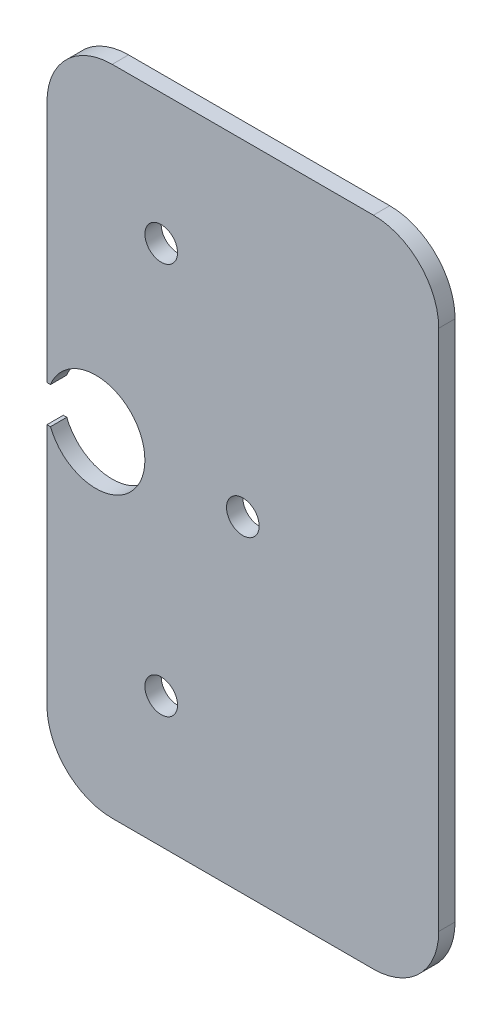
ISO-10303-21;
HEADER;
FILE_DESCRIPTION(('STEP AP214'),'2;1');
FILE_NAME('part.step','',(''),(''),'','','');
FILE_SCHEMA(('AUTOMOTIVE_DESIGN { 1 0 10303 214 1 1 1 1 }'));
ENDSEC;
DATA;
#1=APPLICATION_CONTEXT('core data for automotive mechanical design processes');
#2=APPLICATION_PROTOCOL_DEFINITION('international standard','automotive_design',2000,#1);
#3=PRODUCT_CONTEXT('',#1,'mechanical');
#4=PRODUCT('Part','Part','',(#3));
#5=PRODUCT_RELATED_PRODUCT_CATEGORY('part','',(#4));
#6=PRODUCT_DEFINITION_FORMATION('','',#4);
#7=PRODUCT_DEFINITION_CONTEXT('part definition',#1,'design');
#8=PRODUCT_DEFINITION('design','',#6,#7);
#9=PRODUCT_DEFINITION_SHAPE('','',#8);
#10=(LENGTH_UNIT() NAMED_UNIT(*) SI_UNIT(.MILLI.,.METRE.));
#11=(NAMED_UNIT(*) PLANE_ANGLE_UNIT() SI_UNIT($,.RADIAN.));
#12=(NAMED_UNIT(*) SI_UNIT($,.STERADIAN.) SOLID_ANGLE_UNIT());
#13=UNCERTAINTY_MEASURE_WITH_UNIT(LENGTH_MEASURE(1.E-05),#10,'distance_accuracy_value','');
#14=(GEOMETRIC_REPRESENTATION_CONTEXT(3) GLOBAL_UNCERTAINTY_ASSIGNED_CONTEXT((#13)) GLOBAL_UNIT_ASSIGNED_CONTEXT((#10,
#11,#12)) REPRESENTATION_CONTEXT('',''));
#15=CARTESIAN_POINT('',(0.,0.,0.));
#16=DIRECTION('',(0.,0.,1.));
#17=DIRECTION('',(1.,0.,0.));
#18=AXIS2_PLACEMENT_3D('',#15,#16,#17);
#19=CARTESIAN_POINT('',(-450.215,1024.45552803745,3.175));
#20=DIRECTION('',(0.,0.,1.));
#21=DIRECTION('',(0.,1.,0.));
#22=AXIS2_PLACEMENT_3D('',#19,#20,#21);
#23=ELLIPSE('',#22,9.54794789392333,9.52500000000006);
#24=DIRECTION('',(0.,0.,-1.));
#25=VECTOR('',#24,1.);
#26=SURFACE_OF_LINEAR_EXTRUSION('',#23,#25);
#27=CARTESIAN_POINT('',(-450.215,1024.45552803745,0.));
#28=DIRECTION('',(0.,0.,1.));
#29=DIRECTION('',(0.,1.,0.));
#30=AXIS2_PLACEMENT_3D('',#27,#28,#29);
#31=ELLIPSE('',#30,9.54794789392333,9.52500000000006);
#32=CARTESIAN_POINT('',(-459.058883104327,1020.90986665038,0.));
#33=VERTEX_POINT('',#32);
#34=CARTESIAN_POINT('',(-459.058883104327,1028.00118942453,0.));
#35=VERTEX_POINT('',#34);
#36=EDGE_CURVE('E163',#33,#35,#31,.T.);
#37=ORIENTED_EDGE('',*,*,#36,.F.);
#38=DIRECTION('',(0.,0.,-1.));
#39=VECTOR('',#38,1.);
#40=CARTESIAN_POINT('',(-459.058883104327,1020.90986665038,3.175));
#41=LINE('',#40,#39);
#42=CARTESIAN_POINT('',(-459.058883104327,1020.90986665038,3.175));
#43=VERTEX_POINT('',#42);
#44=EDGE_CURVE('E11',#43,#33,#41,.T.);
#45=ORIENTED_EDGE('',*,*,#44,.F.);
#46=CARTESIAN_POINT('',(-459.058883104327,1028.00118942453,3.175));
#47=VERTEX_POINT('',#46);
#48=EDGE_CURVE('E202',#43,#47,#23,.T.);
#49=ORIENTED_EDGE('',*,*,#48,.T.);
#50=DIRECTION('',(0.,0.,-1.));
#51=VECTOR('',#50,1.);
#52=CARTESIAN_POINT('',(-459.058883104327,1028.00118942453,3.175));
#53=LINE('',#52,#51);
#54=EDGE_CURVE('E98',#47,#35,#53,.T.);
#55=ORIENTED_EDGE('',*,*,#54,.T.);
#56=EDGE_LOOP('',(#37,#45,#49,#55));
#57=FACE_BOUND('',#56,.T.);
#58=ADVANCED_FACE('F35',(#57),#26,.T.);
#59=CARTESIAN_POINT('',(0.,1020.90986665038,3.175));
#60=DIRECTION('',(0.,1.,0.));
#61=DIRECTION('',(0.,0.,1.));
#62=AXIS2_PLACEMENT_3D('',#59,#60,#61);
#63=PLANE('',#62);
#64=DIRECTION('',(1.,0.,0.));
#65=VECTOR('',#64,1.);
#66=CARTESIAN_POINT('',(0.,1020.90986665038,0.));
#67=LINE('',#66,#65);
#68=CARTESIAN_POINT('',(-459.74,1020.90986665038,0.));
#69=VERTEX_POINT('',#68);
#70=EDGE_CURVE('E166',#69,#33,#67,.T.);
#71=ORIENTED_EDGE('',*,*,#70,.F.);
#72=DIRECTION('',(0.,0.,-1.));
#73=VECTOR('',#72,1.);
#74=CARTESIAN_POINT('',(-459.74,1020.90986665038,3.175));
#75=LINE('',#74,#73);
#76=CARTESIAN_POINT('',(-459.74,1020.90986665038,3.175));
#77=VERTEX_POINT('',#76);
#78=EDGE_CURVE('E44',#77,#69,#75,.T.);
#79=ORIENTED_EDGE('',*,*,#78,.F.);
#80=DIRECTION('',(1.,0.,0.));
#81=VECTOR('',#80,1.);
#82=CARTESIAN_POINT('',(0.,1020.90986665038,3.175));
#83=LINE('',#82,#81);
#84=EDGE_CURVE('E242',#77,#43,#83,.T.);
#85=ORIENTED_EDGE('',*,*,#84,.T.);
#86=ORIENTED_EDGE('',*,*,#44,.T.);
#87=EDGE_LOOP('',(#71,#79,#85,#86));
#88=FACE_BOUND('',#87,.T.);
#89=ADVANCED_FACE('F229',(#88),#63,.T.);
#90=CARTESIAN_POINT('',(-459.74,0.,3.175));
#91=DIRECTION('',(-1.,0.,0.));
#92=DIRECTION('',(0.,0.,1.));
#93=AXIS2_PLACEMENT_3D('',#90,#91,#92);
#94=PLANE('',#93);
#95=DIRECTION('',(0.,1.,0.));
#96=VECTOR('',#95,1.);
#97=CARTESIAN_POINT('',(-459.74,0.,0.));
#98=LINE('',#97,#96);
#99=CARTESIAN_POINT('',(-459.74,973.655528037452,0.));
#100=VERTEX_POINT('',#99);
#101=EDGE_CURVE('E169',#100,#69,#98,.T.);
#102=ORIENTED_EDGE('',*,*,#101,.F.);
#103=DIRECTION('',(0.,0.,-1.));
#104=VECTOR('',#103,1.);
#105=CARTESIAN_POINT('',(-459.74,973.655528037452,3.175));
#106=LINE('',#105,#104);
#107=CARTESIAN_POINT('',(-459.74,973.655528037452,3.175));
#108=VERTEX_POINT('',#107);
#109=EDGE_CURVE('E218',#108,#100,#106,.T.);
#110=ORIENTED_EDGE('',*,*,#109,.F.);
#111=DIRECTION('',(0.,1.,0.));
#112=VECTOR('',#111,1.);
#113=CARTESIAN_POINT('',(-459.74,0.,3.175));
#114=LINE('',#113,#112);
#115=EDGE_CURVE('E225',#108,#77,#114,.T.);
#116=ORIENTED_EDGE('',*,*,#115,.T.);
#117=ORIENTED_EDGE('',*,*,#78,.T.);
#118=EDGE_LOOP('',(#102,#110,#116,#117));
#119=FACE_BOUND('',#118,.T.);
#120=ADVANCED_FACE('F223',(#119),#94,.T.);
#121=CARTESIAN_POINT('',(-447.04,973.655528037452,3.175));
#122=DIRECTION('',(0.,0.,-1.));
#123=DIRECTION('',(-1.,0.,0.));
#124=AXIS2_PLACEMENT_3D('',#121,#122,#123);
#125=CYLINDRICAL_SURFACE('',#124,12.7);
#126=CARTESIAN_POINT('',(-447.04,973.655528037452,0.));
#127=DIRECTION('',(0.,0.,1.));
#128=DIRECTION('',(1.,0.,0.));
#129=AXIS2_PLACEMENT_3D('',#126,#127,#128);
#130=CIRCLE('',#129,12.7);
#131=CARTESIAN_POINT('',(-447.04,960.955528037452,0.));
#132=VERTEX_POINT('',#131);
#133=EDGE_CURVE('E172',#132,#100,#130,.F.);
#134=ORIENTED_EDGE('',*,*,#133,.F.);
#135=DIRECTION('',(0.,0.,-1.));
#136=VECTOR('',#135,1.);
#137=CARTESIAN_POINT('',(-447.04,960.955528037452,3.175));
#138=LINE('',#137,#136);
#139=CARTESIAN_POINT('',(-447.04,960.955528037452,3.175));
#140=VERTEX_POINT('',#139);
#141=EDGE_CURVE('E216',#140,#132,#138,.T.);
#142=ORIENTED_EDGE('',*,*,#141,.F.);
#143=CARTESIAN_POINT('',(-447.04,973.655528037452,3.175));
#144=DIRECTION('',(0.,0.,1.));
#145=DIRECTION('',(1.,0.,0.));
#146=AXIS2_PLACEMENT_3D('',#143,#144,#145);
#147=CIRCLE('',#146,12.7);
#148=EDGE_CURVE('E241',#140,#108,#147,.F.);
#149=ORIENTED_EDGE('',*,*,#148,.T.);
#150=ORIENTED_EDGE('',*,*,#109,.T.);
#151=EDGE_LOOP('',(#134,#142,#149,#150));
#152=FACE_BOUND('',#151,.T.);
#153=ADVANCED_FACE('F237',(#152),#125,.T.);
#154=CARTESIAN_POINT('',(2.10014754501576E-12,960.955528037451,3.175));
#155=DIRECTION('',(0.,1.,0.));
#156=DIRECTION('',(-1.,0.,0.));
#157=AXIS2_PLACEMENT_3D('',#154,#155,#156);
#158=PLANE('',#157);
#159=DIRECTION('',(1.,0.,0.));
#160=VECTOR('',#159,1.);
#161=CARTESIAN_POINT('',(2.10014754501576E-12,960.955528037451,0.));
#162=LINE('',#161,#160);
#163=CARTESIAN_POINT('',(-396.24,960.955528037452,0.));
#164=VERTEX_POINT('',#163);
#165=EDGE_CURVE('E175',#132,#164,#162,.T.);
#166=ORIENTED_EDGE('',*,*,#165,.T.);
#167=DIRECTION('',(0.,0.,-1.));
#168=VECTOR('',#167,1.);
#169=CARTESIAN_POINT('',(-396.24,960.955528037452,3.175));
#170=LINE('',#169,#168);
#171=CARTESIAN_POINT('',(-396.24,960.955528037452,3.175));
#172=VERTEX_POINT('',#171);
#173=EDGE_CURVE('E213',#172,#164,#170,.T.);
#174=ORIENTED_EDGE('',*,*,#173,.F.);
#175=DIRECTION('',(1.,0.,0.));
#176=VECTOR('',#175,1.);
#177=CARTESIAN_POINT('',(2.10014754501576E-12,960.955528037451,3.175));
#178=LINE('',#177,#176);
#179=EDGE_CURVE('E244',#140,#172,#178,.T.);
#180=ORIENTED_EDGE('',*,*,#179,.F.);
#181=ORIENTED_EDGE('',*,*,#141,.T.);
#182=EDGE_LOOP('',(#166,#174,#180,#181));
#183=FACE_BOUND('',#182,.T.);
#184=ADVANCED_FACE('F272',(#183),#158,.F.);
#185=CARTESIAN_POINT('',(-396.24,973.655528037452,3.175));
#186=DIRECTION('',(0.,0.,-1.));
#187=DIRECTION('',(-1.,0.,0.));
#188=AXIS2_PLACEMENT_3D('',#185,#186,#187);
#189=CYLINDRICAL_SURFACE('',#188,12.7);
#190=CARTESIAN_POINT('',(-396.24,973.655528037452,0.));
#191=DIRECTION('',(0.,0.,1.));
#192=DIRECTION('',(1.,0.,0.));
#193=AXIS2_PLACEMENT_3D('',#190,#191,#192);
#194=CIRCLE('',#193,12.7);
#195=CARTESIAN_POINT('',(-383.54,973.655528037452,0.));
#196=VERTEX_POINT('',#195);
#197=EDGE_CURVE('E177',#164,#196,#194,.T.);
#198=ORIENTED_EDGE('',*,*,#197,.T.);
#199=DIRECTION('',(0.,0.,-1.));
#200=VECTOR('',#199,1.);
#201=CARTESIAN_POINT('',(-383.54,973.655528037452,3.175));
#202=LINE('',#201,#200);
#203=CARTESIAN_POINT('',(-383.54,973.655528037452,3.175));
#204=VERTEX_POINT('',#203);
#205=EDGE_CURVE('E210',#204,#196,#202,.T.);
#206=ORIENTED_EDGE('',*,*,#205,.F.);
#207=CARTESIAN_POINT('',(-396.24,973.655528037452,3.175));
#208=DIRECTION('',(0.,0.,1.));
#209=DIRECTION('',(1.,0.,0.));
#210=AXIS2_PLACEMENT_3D('',#207,#208,#209);
#211=CIRCLE('',#210,12.7);
#212=EDGE_CURVE('E249',#172,#204,#211,.T.);
#213=ORIENTED_EDGE('',*,*,#212,.F.);
#214=ORIENTED_EDGE('',*,*,#173,.T.);
#215=EDGE_LOOP('',(#198,#206,#213,#214));
#216=FACE_BOUND('',#215,.T.);
#217=ADVANCED_FACE('F275',(#216),#189,.T.);
#218=CARTESIAN_POINT('',(-383.54,0.,3.175));
#219=DIRECTION('',(-1.,0.,0.));
#220=DIRECTION('',(0.,0.,1.));
#221=AXIS2_PLACEMENT_3D('',#218,#219,#220);
#222=PLANE('',#221);
#223=DIRECTION('',(0.,1.,0.));
#224=VECTOR('',#223,1.);
#225=CARTESIAN_POINT('',(-383.54,0.,0.));
#226=LINE('',#225,#224);
#227=CARTESIAN_POINT('',(-383.54,1075.25552803745,0.));
#228=VERTEX_POINT('',#227);
#229=EDGE_CURVE('E179',#196,#228,#226,.T.);
#230=ORIENTED_EDGE('',*,*,#229,.T.);
#231=DIRECTION('',(0.,0.,-1.));
#232=VECTOR('',#231,1.);
#233=CARTESIAN_POINT('',(-383.54,1075.25552803745,3.175));
#234=LINE('',#233,#232);
#235=CARTESIAN_POINT('',(-383.54,1075.25552803745,3.175));
#236=VERTEX_POINT('',#235);
#237=EDGE_CURVE('E208',#236,#228,#234,.T.);
#238=ORIENTED_EDGE('',*,*,#237,.F.);
#239=DIRECTION('',(0.,1.,0.));
#240=VECTOR('',#239,1.);
#241=CARTESIAN_POINT('',(-383.54,0.,3.175));
#242=LINE('',#241,#240);
#243=EDGE_CURVE('E251',#204,#236,#242,.T.);
#244=ORIENTED_EDGE('',*,*,#243,.F.);
#245=ORIENTED_EDGE('',*,*,#205,.T.);
#246=EDGE_LOOP('',(#230,#238,#244,#245));
#247=FACE_BOUND('',#246,.T.);
#248=ADVANCED_FACE('F279',(#247),#222,.F.);
#249=CARTESIAN_POINT('',(-396.24,1075.25552803745,3.175));
#250=DIRECTION('',(0.,0.,-1.));
#251=DIRECTION('',(-1.,0.,0.));
#252=AXIS2_PLACEMENT_3D('',#249,#250,#251);
#253=CYLINDRICAL_SURFACE('',#252,12.7);
#254=CARTESIAN_POINT('',(-396.24,1075.25552803745,0.));
#255=DIRECTION('',(0.,0.,1.));
#256=DIRECTION('',(1.,0.,0.));
#257=AXIS2_PLACEMENT_3D('',#254,#255,#256);
#258=CIRCLE('',#257,12.7);
#259=CARTESIAN_POINT('',(-396.24,1087.95552803745,0.));
#260=VERTEX_POINT('',#259);
#261=EDGE_CURVE('E182',#260,#228,#258,.F.);
#262=ORIENTED_EDGE('',*,*,#261,.F.);
#263=DIRECTION('',(0.,0.,-1.));
#264=VECTOR('',#263,1.);
#265=CARTESIAN_POINT('',(-396.24,1087.95552803745,3.175));
#266=LINE('',#265,#264);
#267=CARTESIAN_POINT('',(-396.24,1087.95552803745,3.175));
#268=VERTEX_POINT('',#267);
#269=EDGE_CURVE('E206',#268,#260,#266,.T.);
#270=ORIENTED_EDGE('',*,*,#269,.F.);
#271=CARTESIAN_POINT('',(-396.24,1075.25552803745,3.175));
#272=DIRECTION('',(0.,0.,1.));
#273=DIRECTION('',(1.,0.,0.));
#274=AXIS2_PLACEMENT_3D('',#271,#272,#273);
#275=CIRCLE('',#274,12.7);
#276=EDGE_CURVE('E253',#268,#236,#275,.F.);
#277=ORIENTED_EDGE('',*,*,#276,.T.);
#278=ORIENTED_EDGE('',*,*,#237,.T.);
#279=EDGE_LOOP('',(#262,#270,#277,#278));
#280=FACE_BOUND('',#279,.T.);
#281=ADVANCED_FACE('F283',(#280),#253,.T.);
#282=CARTESIAN_POINT('',(0.,1087.95552803745,3.175));
#283=DIRECTION('',(0.,1.,0.));
#284=DIRECTION('',(0.,0.,1.));
#285=AXIS2_PLACEMENT_3D('',#282,#283,#284);
#286=PLANE('',#285);
#287=DIRECTION('',(1.,0.,0.));
#288=VECTOR('',#287,1.);
#289=CARTESIAN_POINT('',(0.,1087.95552803745,0.));
#290=LINE('',#289,#288);
#291=CARTESIAN_POINT('',(-447.04,1087.95552803745,0.));
#292=VERTEX_POINT('',#291);
#293=EDGE_CURVE('E185',#292,#260,#290,.T.);
#294=ORIENTED_EDGE('',*,*,#293,.F.);
#295=DIRECTION('',(0.,0.,-1.));
#296=VECTOR('',#295,1.);
#297=CARTESIAN_POINT('',(-447.04,1087.95552803745,3.175));
#298=LINE('',#297,#296);
#299=CARTESIAN_POINT('',(-447.04,1087.95552803745,3.175));
#300=VERTEX_POINT('',#299);
#301=EDGE_CURVE('E139',#300,#292,#298,.T.);
#302=ORIENTED_EDGE('',*,*,#301,.F.);
#303=DIRECTION('',(1.,0.,0.));
#304=VECTOR('',#303,1.);
#305=CARTESIAN_POINT('',(0.,1087.95552803745,3.175));
#306=LINE('',#305,#304);
#307=EDGE_CURVE('E147',#300,#268,#306,.T.);
#308=ORIENTED_EDGE('',*,*,#307,.T.);
#309=ORIENTED_EDGE('',*,*,#269,.T.);
#310=EDGE_LOOP('',(#294,#302,#308,#309));
#311=FACE_BOUND('',#310,.T.);
#312=ADVANCED_FACE('F257',(#311),#286,.T.);
#313=CARTESIAN_POINT('',(-447.04,1075.25552803745,3.175));
#314=DIRECTION('',(0.,0.,-1.));
#315=DIRECTION('',(-1.,0.,0.));
#316=AXIS2_PLACEMENT_3D('',#313,#314,#315);
#317=CYLINDRICAL_SURFACE('',#316,12.7);
#318=CARTESIAN_POINT('',(-447.04,1075.25552803745,0.));
#319=DIRECTION('',(0.,0.,1.));
#320=DIRECTION('',(1.,0.,0.));
#321=AXIS2_PLACEMENT_3D('',#318,#319,#320);
#322=CIRCLE('',#321,12.7);
#323=CARTESIAN_POINT('',(-459.74,1075.25552803745,0.));
#324=VERTEX_POINT('',#323);
#325=EDGE_CURVE('E134',#324,#292,#322,.F.);
#326=ORIENTED_EDGE('',*,*,#325,.F.);
#327=DIRECTION('',(0.,0.,-1.));
#328=VECTOR('',#327,1.);
#329=CARTESIAN_POINT('',(-459.74,1075.25552803745,3.175));
#330=LINE('',#329,#328);
#331=CARTESIAN_POINT('',(-459.74,1075.25552803745,3.175));
#332=VERTEX_POINT('',#331);
#333=EDGE_CURVE('E129',#332,#324,#330,.T.);
#334=ORIENTED_EDGE('',*,*,#333,.F.);
#335=CARTESIAN_POINT('',(-447.04,1075.25552803745,3.175));
#336=DIRECTION('',(0.,0.,1.));
#337=DIRECTION('',(1.,0.,0.));
#338=AXIS2_PLACEMENT_3D('',#335,#336,#337);
#339=CIRCLE('',#338,12.7);
#340=EDGE_CURVE('E132',#332,#300,#339,.F.);
#341=ORIENTED_EDGE('',*,*,#340,.T.);
#342=ORIENTED_EDGE('',*,*,#301,.T.);
#343=EDGE_LOOP('',(#326,#334,#341,#342));
#344=FACE_BOUND('',#343,.T.);
#345=ADVANCED_FACE('F131',(#344),#317,.T.);
#346=CARTESIAN_POINT('',(-459.74,0.,3.175));
#347=DIRECTION('',(-1.,0.,0.));
#348=DIRECTION('',(0.,0.,1.));
#349=AXIS2_PLACEMENT_3D('',#346,#347,#348);
#350=PLANE('',#349);
#351=DIRECTION('',(0.,1.,0.));
#352=VECTOR('',#351,1.);
#353=CARTESIAN_POINT('',(-459.74,0.,0.));
#354=LINE('',#353,#352);
#355=CARTESIAN_POINT('',(-459.74,1028.00118942453,0.));
#356=VERTEX_POINT('',#355);
#357=EDGE_CURVE('E189',#356,#324,#354,.T.);
#358=ORIENTED_EDGE('',*,*,#357,.F.);
#359=DIRECTION('',(0.,0.,-1.));
#360=VECTOR('',#359,1.);
#361=CARTESIAN_POINT('',(-459.74,1028.00118942453,3.175));
#362=LINE('',#361,#360);
#363=CARTESIAN_POINT('',(-459.74,1028.00118942453,3.175));
#364=VERTEX_POINT('',#363);
#365=EDGE_CURVE('E91',#364,#356,#362,.T.);
#366=ORIENTED_EDGE('',*,*,#365,.F.);
#367=DIRECTION('',(0.,1.,0.));
#368=VECTOR('',#367,1.);
#369=CARTESIAN_POINT('',(-459.74,0.,3.175));
#370=LINE('',#369,#368);
#371=EDGE_CURVE('E144',#364,#332,#370,.T.);
#372=ORIENTED_EDGE('',*,*,#371,.T.);
#373=ORIENTED_EDGE('',*,*,#333,.T.);
#374=EDGE_LOOP('',(#358,#366,#372,#373));
#375=FACE_BOUND('',#374,.T.);
#376=ADVANCED_FACE('F149',(#375),#350,.T.);
#377=CARTESIAN_POINT('',(-437.515,986.355528037452,3.175));
#378=DIRECTION('',(0.,0.,-1.));
#379=DIRECTION('',(-1.,0.,0.));
#380=AXIS2_PLACEMENT_3D('',#377,#378,#379);
#381=CYLINDRICAL_SURFACE('',#380,3.17499999999981);
#382=CARTESIAN_POINT('',(-437.515,986.355528037452,3.175));
#383=DIRECTION('',(0.,0.,1.));
#384=DIRECTION('',(1.,0.,0.));
#385=AXIS2_PLACEMENT_3D('',#382,#383,#384);
#386=CIRCLE('',#385,3.17499999999981);
#387=CARTESIAN_POINT('',(-434.34,986.355528037452,3.175));
#388=VERTEX_POINT('',#387);
#389=EDGE_CURVE('E157',#388,#388,#386,.T.);
#390=ORIENTED_EDGE('',*,*,#389,.T.);
#391=EDGE_LOOP('',(#390));
#392=FACE_BOUND('',#391,.T.);
#393=CARTESIAN_POINT('',(-437.515,986.355528037452,0.));
#394=DIRECTION('',(0.,0.,1.));
#395=DIRECTION('',(1.,0.,0.));
#396=AXIS2_PLACEMENT_3D('',#393,#394,#395);
#397=CIRCLE('',#396,3.17499999999981);
#398=CARTESIAN_POINT('',(-434.34,986.355528037452,0.));
#399=VERTEX_POINT('',#398);
#400=EDGE_CURVE('E196',#399,#399,#397,.T.);
#401=ORIENTED_EDGE('',*,*,#400,.F.);
#402=EDGE_LOOP('',(#401));
#403=FACE_BOUND('',#402,.T.);
#404=ADVANCED_FACE('F294',(#392,#403),#381,.F.);
#405=CARTESIAN_POINT('',(-421.64,1024.45552803745,3.175));
#406=DIRECTION('',(0.,0.,-1.));
#407=DIRECTION('',(-1.,0.,0.));
#408=AXIS2_PLACEMENT_3D('',#405,#406,#407);
#409=CYLINDRICAL_SURFACE('',#408,3.17499999999967);
#410=CARTESIAN_POINT('',(-421.64,1024.45552803745,3.175));
#411=DIRECTION('',(0.,0.,1.));
#412=DIRECTION('',(1.,0.,0.));
#413=AXIS2_PLACEMENT_3D('',#410,#411,#412);
#414=CIRCLE('',#413,3.17499999999967);
#415=CARTESIAN_POINT('',(-418.465,1024.45552803745,3.175));
#416=VERTEX_POINT('',#415);
#417=EDGE_CURVE('E151',#416,#416,#414,.T.);
#418=ORIENTED_EDGE('',*,*,#417,.T.);
#419=EDGE_LOOP('',(#418));
#420=FACE_BOUND('',#419,.T.);
#421=CARTESIAN_POINT('',(-421.64,1024.45552803745,0.));
#422=DIRECTION('',(0.,0.,1.));
#423=DIRECTION('',(1.,0.,0.));
#424=AXIS2_PLACEMENT_3D('',#421,#422,#423);
#425=CIRCLE('',#424,3.17499999999967);
#426=CARTESIAN_POINT('',(-418.465,1024.45552803745,0.));
#427=VERTEX_POINT('',#426);
#428=EDGE_CURVE('E193',#427,#427,#425,.T.);
#429=ORIENTED_EDGE('',*,*,#428,.F.);
#430=EDGE_LOOP('',(#429));
#431=FACE_BOUND('',#430,.T.);
#432=ADVANCED_FACE('F298',(#420,#431),#409,.F.);
#433=CARTESIAN_POINT('',(0.,1028.00118942453,3.175));
#434=DIRECTION('',(0.,1.,0.));
#435=DIRECTION('',(0.,0.,1.));
#436=AXIS2_PLACEMENT_3D('',#433,#434,#435);
#437=PLANE('',#436);
#438=DIRECTION('',(1.,0.,0.));
#439=VECTOR('',#438,1.);
#440=CARTESIAN_POINT('',(0.,1028.00118942453,0.));
#441=LINE('',#440,#439);
#442=EDGE_CURVE('E191',#356,#35,#441,.T.);
#443=ORIENTED_EDGE('',*,*,#442,.T.);
#444=ORIENTED_EDGE('',*,*,#54,.F.);
#445=DIRECTION('',(1.,0.,0.));
#446=VECTOR('',#445,1.);
#447=CARTESIAN_POINT('',(0.,1028.00118942453,3.175));
#448=LINE('',#447,#446);
#449=EDGE_CURVE('E52',#364,#47,#448,.T.);
#450=ORIENTED_EDGE('',*,*,#449,.F.);
#451=ORIENTED_EDGE('',*,*,#365,.T.);
#452=EDGE_LOOP('',(#443,#444,#450,#451));
#453=FACE_BOUND('',#452,.T.);
#454=ADVANCED_FACE('F259',(#453),#437,.F.);
#455=CARTESIAN_POINT('',(-437.515,1062.55552803745,3.175));
#456=DIRECTION('',(0.,0.,-1.));
#457=DIRECTION('',(-1.,0.,0.));
#458=AXIS2_PLACEMENT_3D('',#455,#456,#457);
#459=CYLINDRICAL_SURFACE('',#458,3.17499999999967);
#460=CARTESIAN_POINT('',(-437.515,1062.55552803745,3.175));
#461=DIRECTION('',(0.,0.,1.));
#462=DIRECTION('',(1.,0.,0.));
#463=AXIS2_PLACEMENT_3D('',#460,#461,#462);
#464=CIRCLE('',#463,3.17499999999967);
#465=CARTESIAN_POINT('',(-434.34,1062.55552803745,3.175));
#466=VERTEX_POINT('',#465);
#467=EDGE_CURVE('E160',#466,#466,#464,.T.);
#468=ORIENTED_EDGE('',*,*,#467,.T.);
#469=EDGE_LOOP('',(#468));
#470=FACE_BOUND('',#469,.T.);
#471=CARTESIAN_POINT('',(-437.515,1062.55552803745,0.));
#472=DIRECTION('',(0.,0.,1.));
#473=DIRECTION('',(1.,0.,0.));
#474=AXIS2_PLACEMENT_3D('',#471,#472,#473);
#475=CIRCLE('',#474,3.17499999999967);
#476=CARTESIAN_POINT('',(-434.34,1062.55552803745,0.));
#477=VERTEX_POINT('',#476);
#478=EDGE_CURVE('E199',#477,#477,#475,.T.);
#479=ORIENTED_EDGE('',*,*,#478,.F.);
#480=EDGE_LOOP('',(#479));
#481=FACE_BOUND('',#480,.T.);
#482=ADVANCED_FACE('F297',(#470,#481),#459,.F.);
#483=CARTESIAN_POINT('',(0.,0.,3.175));
#484=DIRECTION('',(0.,0.,1.));
#485=DIRECTION('',(1.,0.,0.));
#486=AXIS2_PLACEMENT_3D('',#483,#484,#485);
#487=PLANE('',#486);
#488=ORIENTED_EDGE('',*,*,#48,.F.);
#489=ORIENTED_EDGE('',*,*,#84,.F.);
#490=ORIENTED_EDGE('',*,*,#115,.F.);
#491=ORIENTED_EDGE('',*,*,#148,.F.);
#492=ORIENTED_EDGE('',*,*,#179,.T.);
#493=ORIENTED_EDGE('',*,*,#212,.T.);
#494=ORIENTED_EDGE('',*,*,#243,.T.);
#495=ORIENTED_EDGE('',*,*,#276,.F.);
#496=ORIENTED_EDGE('',*,*,#307,.F.);
#497=ORIENTED_EDGE('',*,*,#340,.F.);
#498=ORIENTED_EDGE('',*,*,#371,.F.);
#499=ORIENTED_EDGE('',*,*,#449,.T.);
#500=EDGE_LOOP('',(#488,#489,#490,#491,#492,#493,#494,#495,#496,#497,#498,#499));
#501=FACE_BOUND('',#500,.T.);
#502=ORIENTED_EDGE('',*,*,#417,.F.);
#503=EDGE_LOOP('',(#502));
#504=FACE_BOUND('',#503,.T.);
#505=ORIENTED_EDGE('',*,*,#389,.F.);
#506=EDGE_LOOP('',(#505));
#507=FACE_BOUND('',#506,.T.);
#508=ORIENTED_EDGE('',*,*,#467,.F.);
#509=EDGE_LOOP('',(#508));
#510=FACE_BOUND('',#509,.T.);
#511=ADVANCED_FACE('F142',(#501,#504,#507,#510),#487,.T.);
#512=CARTESIAN_POINT('',(0.,0.,0.));
#513=DIRECTION('',(0.,0.,1.));
#514=DIRECTION('',(1.,0.,0.));
#515=AXIS2_PLACEMENT_3D('',#512,#513,#514);
#516=PLANE('',#515);
#517=ORIENTED_EDGE('',*,*,#36,.T.);
#518=ORIENTED_EDGE('',*,*,#442,.F.);
#519=ORIENTED_EDGE('',*,*,#357,.T.);
#520=ORIENTED_EDGE('',*,*,#325,.T.);
#521=ORIENTED_EDGE('',*,*,#293,.T.);
#522=ORIENTED_EDGE('',*,*,#261,.T.);
#523=ORIENTED_EDGE('',*,*,#229,.F.);
#524=ORIENTED_EDGE('',*,*,#197,.F.);
#525=ORIENTED_EDGE('',*,*,#165,.F.);
#526=ORIENTED_EDGE('',*,*,#133,.T.);
#527=ORIENTED_EDGE('',*,*,#101,.T.);
#528=ORIENTED_EDGE('',*,*,#70,.T.);
#529=EDGE_LOOP('',(#517,#518,#519,#520,#521,#522,#523,#524,#525,#526,#527,#528));
#530=FACE_BOUND('',#529,.T.);
#531=ORIENTED_EDGE('',*,*,#428,.T.);
#532=EDGE_LOOP('',(#531));
#533=FACE_BOUND('',#532,.T.);
#534=ORIENTED_EDGE('',*,*,#400,.T.);
#535=EDGE_LOOP('',(#534));
#536=FACE_BOUND('',#535,.T.);
#537=ORIENTED_EDGE('',*,*,#478,.T.);
#538=EDGE_LOOP('',(#537));
#539=FACE_BOUND('',#538,.T.);
#540=ADVANCED_FACE('F231',(#530,#533,#536,#539),#516,.F.);
#541=CLOSED_SHELL('',(#58,#89,#120,#153,#184,#217,#248,#281,#312,#345,#376,#404,#432,#454,#482,
#511,#540));
#542=MANIFOLD_SOLID_BREP('B2',#541);
#543=ADVANCED_BREP_SHAPE_REPRESENTATION('',(#18,#542),#14);
#544=SHAPE_DEFINITION_REPRESENTATION(#9,#543);
ENDSEC;
END-ISO-10303-21;
